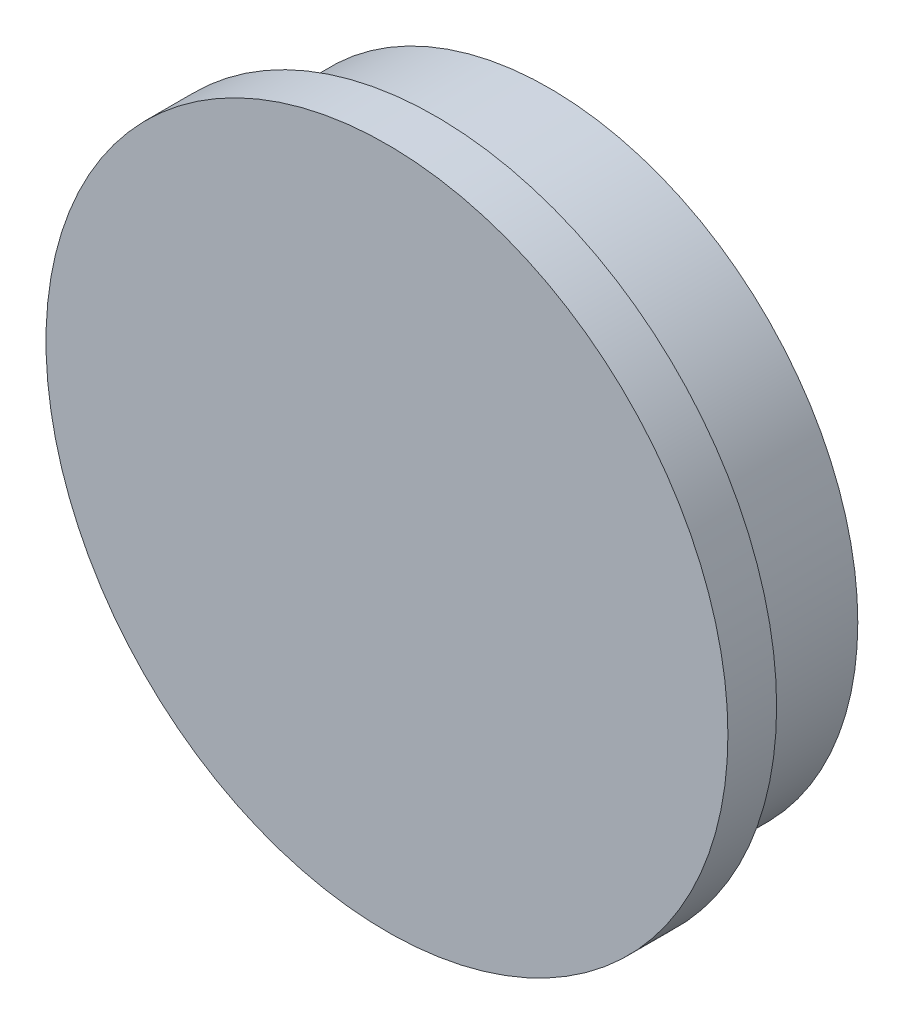
ISO-10303-21;
HEADER;
FILE_DESCRIPTION(('STEP AP214'),'2;1');
FILE_NAME('part.step','',(''),(''),'','','');
FILE_SCHEMA(('AUTOMOTIVE_DESIGN { 1 0 10303 214 1 1 1 1 }'));
ENDSEC;
DATA;
#1=APPLICATION_CONTEXT('core data for automotive mechanical design processes');
#2=APPLICATION_PROTOCOL_DEFINITION('international standard','automotive_design',2000,#1);
#3=PRODUCT_CONTEXT('',#1,'mechanical');
#4=PRODUCT('Part','Part','',(#3));
#5=PRODUCT_RELATED_PRODUCT_CATEGORY('part','',(#4));
#6=PRODUCT_DEFINITION_FORMATION('','',#4);
#7=PRODUCT_DEFINITION_CONTEXT('part definition',#1,'design');
#8=PRODUCT_DEFINITION('design','',#6,#7);
#9=PRODUCT_DEFINITION_SHAPE('','',#8);
#10=(LENGTH_UNIT() NAMED_UNIT(*) SI_UNIT(.MILLI.,.METRE.));
#11=(NAMED_UNIT(*) PLANE_ANGLE_UNIT() SI_UNIT($,.RADIAN.));
#12=(NAMED_UNIT(*) SI_UNIT($,.STERADIAN.) SOLID_ANGLE_UNIT());
#13=UNCERTAINTY_MEASURE_WITH_UNIT(LENGTH_MEASURE(1.E-05),#10,'distance_accuracy_value','');
#14=(GEOMETRIC_REPRESENTATION_CONTEXT(3) GLOBAL_UNCERTAINTY_ASSIGNED_CONTEXT((#13)) GLOBAL_UNIT_ASSIGNED_CONTEXT((#10,
#11,#12)) REPRESENTATION_CONTEXT('',''));
#15=CARTESIAN_POINT('',(0.,0.,0.));
#16=DIRECTION('',(0.,0.,1.));
#17=DIRECTION('',(1.,0.,0.));
#18=AXIS2_PLACEMENT_3D('',#15,#16,#17);
#19=CARTESIAN_POINT('',(0.,0.,0.));
#20=DIRECTION('',(0.,0.,-1.));
#21=DIRECTION('',(-1.,0.,0.));
#22=AXIS2_PLACEMENT_3D('',#19,#20,#21);
#23=PLANE('',#22);
#24=CARTESIAN_POINT('',(0.,0.,0.));
#25=DIRECTION('',(0.,0.,1.));
#26=DIRECTION('',(1.,0.,0.));
#27=AXIS2_PLACEMENT_3D('',#24,#25,#26);
#28=CIRCLE('',#27,21.);
#29=CARTESIAN_POINT('',(21.,0.,0.));
#30=VERTEX_POINT('',#29);
#31=EDGE_CURVE('E10',#30,#30,#28,.T.);
#32=ORIENTED_EDGE('',*,*,#31,.T.);
#33=EDGE_LOOP('',(#32));
#34=FACE_BOUND('',#33,.T.);
#35=ADVANCED_FACE('F32',(#34),#23,.F.);
#36=CARTESIAN_POINT('',(0.,0.,0.));
#37=DIRECTION('',(0.,0.,1.));
#38=DIRECTION('',(1.,0.,0.));
#39=AXIS2_PLACEMENT_3D('',#36,#37,#38);
#40=CYLINDRICAL_SURFACE('',#39,21.);
#41=ORIENTED_EDGE('',*,*,#31,.F.);
#42=EDGE_LOOP('',(#41));
#43=FACE_BOUND('',#42,.T.);
#44=CARTESIAN_POINT('',(0.,0.,-3.));
#45=DIRECTION('',(0.,0.,1.));
#46=DIRECTION('',(1.,0.,0.));
#47=AXIS2_PLACEMENT_3D('',#44,#45,#46);
#48=CIRCLE('',#47,21.);
#49=CARTESIAN_POINT('',(21.,0.,-3.));
#50=VERTEX_POINT('',#49);
#51=EDGE_CURVE('E38',#50,#50,#48,.T.);
#52=ORIENTED_EDGE('',*,*,#51,.T.);
#53=EDGE_LOOP('',(#52));
#54=FACE_BOUND('',#53,.T.);
#55=ADVANCED_FACE('F64',(#43,#54),#40,.T.);
#56=CARTESIAN_POINT('',(0.,21.,-3.));
#57=DIRECTION('',(0.,0.,1.));
#58=DIRECTION('',(1.,0.,0.));
#59=AXIS2_PLACEMENT_3D('',#56,#57,#58);
#60=PLANE('',#59);
#61=ORIENTED_EDGE('',*,*,#51,.F.);
#62=EDGE_LOOP('',(#61));
#63=FACE_BOUND('',#62,.T.);
#64=CARTESIAN_POINT('',(0.,0.,-3.));
#65=DIRECTION('',(0.,0.,1.));
#66=DIRECTION('',(1.,0.,0.));
#67=AXIS2_PLACEMENT_3D('',#64,#65,#66);
#68=CIRCLE('',#67,19.);
#69=CARTESIAN_POINT('',(19.,0.,-3.));
#70=VERTEX_POINT('',#69);
#71=EDGE_CURVE('E42',#70,#70,#68,.T.);
#72=ORIENTED_EDGE('',*,*,#71,.T.);
#73=EDGE_LOOP('',(#72));
#74=FACE_BOUND('',#73,.T.);
#75=ADVANCED_FACE('F60',(#63,#74),#60,.F.);
#76=CARTESIAN_POINT('',(0.,0.,0.));
#77=DIRECTION('',(0.,0.,1.));
#78=DIRECTION('',(1.,0.,0.));
#79=AXIS2_PLACEMENT_3D('',#76,#77,#78);
#80=CYLINDRICAL_SURFACE('',#79,19.);
#81=ORIENTED_EDGE('',*,*,#71,.F.);
#82=EDGE_LOOP('',(#81));
#83=FACE_BOUND('',#82,.T.);
#84=CARTESIAN_POINT('',(0.,0.,-10.));
#85=DIRECTION('',(0.,0.,1.));
#86=DIRECTION('',(1.,0.,0.));
#87=AXIS2_PLACEMENT_3D('',#84,#85,#86);
#88=CIRCLE('',#87,19.);
#89=CARTESIAN_POINT('',(19.,0.,-10.));
#90=VERTEX_POINT('',#89);
#91=EDGE_CURVE('E46',#90,#90,#88,.T.);
#92=ORIENTED_EDGE('',*,*,#91,.T.);
#93=EDGE_LOOP('',(#92));
#94=FACE_BOUND('',#93,.T.);
#95=ADVANCED_FACE('F52',(#83,#94),#80,.T.);
#96=CARTESIAN_POINT('',(0.,19.,-10.));
#97=DIRECTION('',(0.,0.,1.));
#98=DIRECTION('',(1.,0.,0.));
#99=AXIS2_PLACEMENT_3D('',#96,#97,#98);
#100=PLANE('',#99);
#101=ORIENTED_EDGE('',*,*,#91,.F.);
#102=EDGE_LOOP('',(#101));
#103=FACE_BOUND('',#102,.T.);
#104=ADVANCED_FACE('F54',(#103),#100,.F.);
#105=CLOSED_SHELL('',(#35,#55,#75,#95,#104));
#106=MANIFOLD_SOLID_BREP('B2',#105);
#107=ADVANCED_BREP_SHAPE_REPRESENTATION('',(#18,#106),#14);
#108=SHAPE_DEFINITION_REPRESENTATION(#9,#107);
ENDSEC;
END-ISO-10303-21;
